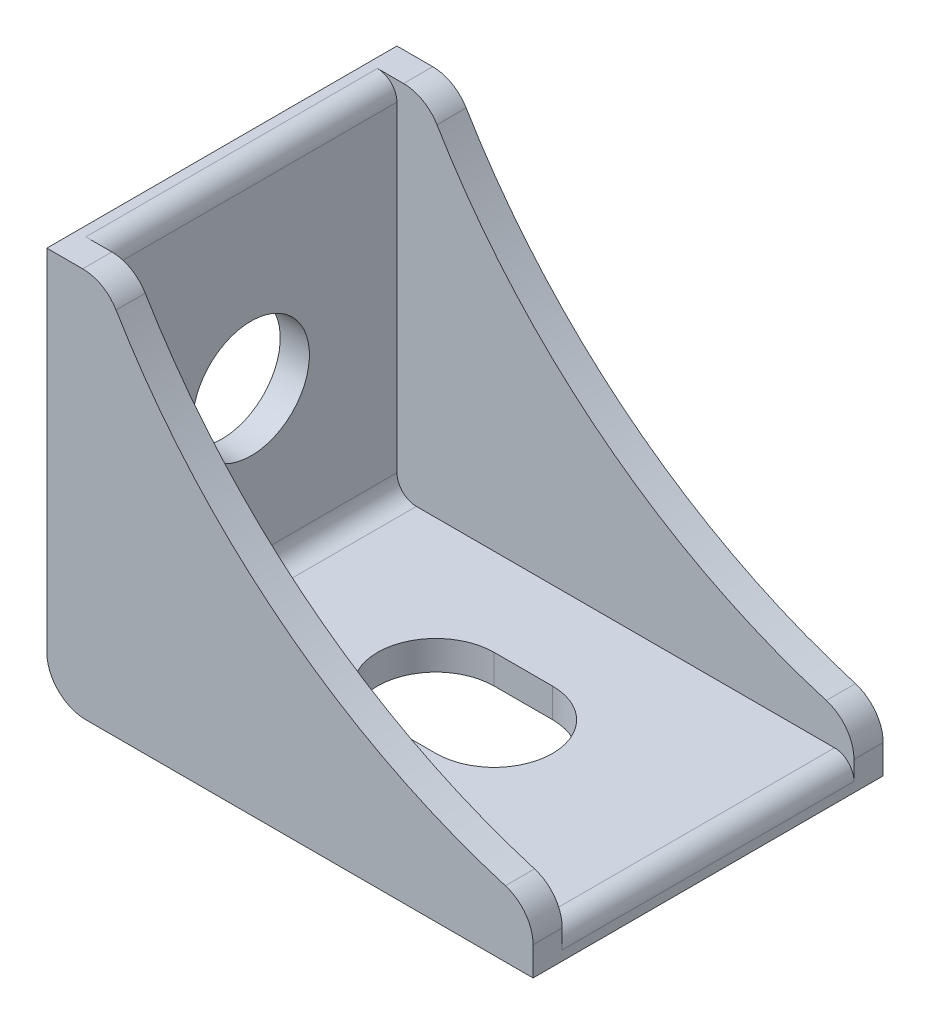
ISO-10303-21;
HEADER;
FILE_DESCRIPTION(('STEP AP214'),'2;1');
FILE_NAME('part.step','',(''),(''),'','','');
FILE_SCHEMA(('AUTOMOTIVE_DESIGN { 1 0 10303 214 1 1 1 1 }'));
ENDSEC;
DATA;
#1=APPLICATION_CONTEXT('core data for automotive mechanical design processes');
#2=APPLICATION_PROTOCOL_DEFINITION('international standard','automotive_design',2000,#1);
#3=PRODUCT_CONTEXT('',#1,'mechanical');
#4=PRODUCT('Part','Part','',(#3));
#5=PRODUCT_RELATED_PRODUCT_CATEGORY('part','',(#4));
#6=PRODUCT_DEFINITION_FORMATION('','',#4);
#7=PRODUCT_DEFINITION_CONTEXT('part definition',#1,'design');
#8=PRODUCT_DEFINITION('design','',#6,#7);
#9=PRODUCT_DEFINITION_SHAPE('','',#8);
#10=(LENGTH_UNIT() NAMED_UNIT(*) SI_UNIT(.MILLI.,.METRE.));
#11=(NAMED_UNIT(*) PLANE_ANGLE_UNIT() SI_UNIT($,.RADIAN.));
#12=(NAMED_UNIT(*) SI_UNIT($,.STERADIAN.) SOLID_ANGLE_UNIT());
#13=UNCERTAINTY_MEASURE_WITH_UNIT(LENGTH_MEASURE(1.E-05),#10,'distance_accuracy_value','');
#14=(GEOMETRIC_REPRESENTATION_CONTEXT(3) GLOBAL_UNCERTAINTY_ASSIGNED_CONTEXT((#13)) GLOBAL_UNIT_ASSIGNED_CONTEXT((#10,
#11,#12)) REPRESENTATION_CONTEXT('',''));
#15=CARTESIAN_POINT('',(0.,0.,0.));
#16=DIRECTION('',(0.,0.,1.));
#17=DIRECTION('',(1.,0.,0.));
#18=AXIS2_PLACEMENT_3D('',#15,#16,#17);
#19=CARTESIAN_POINT('',(33.640222937901,36.9167590961072,-20.));
#20=DIRECTION('',(0.,0.,1.));
#21=DIRECTION('',(1.,0.,0.));
#22=AXIS2_PLACEMENT_3D('',#19,#20,#21);
#23=CYLINDRICAL_SURFACE('',#22,35.);
#24=CARTESIAN_POINT('',(33.640222937901,36.9167590961072,-18.));
#25=DIRECTION('',(0.,0.,1.));
#26=DIRECTION('',(1.,0.,0.));
#27=AXIS2_PLACEMENT_3D('',#24,#25,#26);
#28=CIRCLE('',#27,35.);
#29=CARTESIAN_POINT('',(3.56038789423049,19.0225275187085,-18.));
#30=VERTEX_POINT('',#29);
#31=CARTESIAN_POINT('',(23.5751471858325,3.39521005515261,-18.));
#32=VERTEX_POINT('',#31);
#33=EDGE_CURVE('E233',#30,#32,#28,.T.);
#34=ORIENTED_EDGE('',*,*,#33,.F.);
#35=DIRECTION('',(0.,0.,1.));
#36=VECTOR('',#35,1.);
#37=CARTESIAN_POINT('',(3.56038789423049,19.0225275187085,-20.));
#38=LINE('',#37,#36);
#39=CARTESIAN_POINT('',(3.56038789423049,19.0225275187085,-16.5));
#40=VERTEX_POINT('',#39);
#41=EDGE_CURVE('E363',#30,#40,#38,.T.);
#42=ORIENTED_EDGE('',*,*,#41,.T.);
#43=CARTESIAN_POINT('',(33.640222937901,36.9167590961072,-16.5));
#44=DIRECTION('',(0.,0.,-1.));
#45=DIRECTION('',(-1.,0.,0.));
#46=AXIS2_PLACEMENT_3D('',#43,#44,#45);
#47=CIRCLE('',#46,35.);
#48=CARTESIAN_POINT('',(23.5751471858325,3.39521005515261,-16.5));
#49=VERTEX_POINT('',#48);
#50=EDGE_CURVE('E280',#40,#49,#47,.F.);
#51=ORIENTED_EDGE('',*,*,#50,.T.);
#52=DIRECTION('',(0.,0.,1.));
#53=VECTOR('',#52,1.);
#54=CARTESIAN_POINT('',(23.5751471858325,3.3952100551526,-20.));
#55=LINE('',#54,#53);
#56=EDGE_CURVE('E360',#49,#32,#55,.F.);
#57=ORIENTED_EDGE('',*,*,#56,.T.);
#58=EDGE_LOOP('',(#34,#42,#51,#57));
#59=FACE_BOUND('',#58,.T.);
#60=ADVANCED_FACE('F39',(#59),#23,.F.);
#61=CARTESIAN_POINT('',(0.,20.,0.));
#62=DIRECTION('',(1.,0.,0.));
#63=DIRECTION('',(0.,0.,-1.));
#64=AXIS2_PLACEMENT_3D('',#61,#62,#63);
#65=PLANE('',#64);
#66=CARTESIAN_POINT('',(0.,10.,-9.));
#67=DIRECTION('',(-1.,0.,0.));
#68=DIRECTION('',(0.,0.,1.));
#69=AXIS2_PLACEMENT_3D('',#66,#67,#68);
#70=CIRCLE('',#69,3.);
#71=CARTESIAN_POINT('',(0.,10.,-6.));
#72=VERTEX_POINT('',#71);
#73=EDGE_CURVE('E226',#72,#72,#70,.T.);
#74=ORIENTED_EDGE('',*,*,#73,.F.);
#75=EDGE_LOOP('',(#74));
#76=FACE_BOUND('',#75,.T.);
#77=DIRECTION('',(0.,-1.,0.));
#78=VECTOR('',#77,1.);
#79=CARTESIAN_POINT('',(0.,20.,-18.));
#80=LINE('',#79,#78);
#81=CARTESIAN_POINT('',(0.,20.,-18.));
#82=VERTEX_POINT('',#81);
#83=CARTESIAN_POINT('',(0.,2.,-18.));
#84=VERTEX_POINT('',#83);
#85=EDGE_CURVE('E250',#82,#84,#80,.T.);
#86=ORIENTED_EDGE('',*,*,#85,.T.);
#87=DIRECTION('',(0.,0.,1.));
#88=VECTOR('',#87,1.);
#89=CARTESIAN_POINT('',(0.,2.,0.));
#90=LINE('',#89,#88);
#91=CARTESIAN_POINT('',(0.,2.,0.));
#92=VERTEX_POINT('',#91);
#93=EDGE_CURVE('E327',#84,#92,#90,.T.);
#94=ORIENTED_EDGE('',*,*,#93,.T.);
#95=DIRECTION('',(0.,-1.,0.));
#96=VECTOR('',#95,1.);
#97=CARTESIAN_POINT('',(0.,20.,0.));
#98=LINE('',#97,#96);
#99=CARTESIAN_POINT('',(0.,20.,0.));
#100=VERTEX_POINT('',#99);
#101=EDGE_CURVE('E199',#100,#92,#98,.T.);
#102=ORIENTED_EDGE('',*,*,#101,.F.);
#103=DIRECTION('',(0.,0.,1.));
#104=VECTOR('',#103,1.);
#105=CARTESIAN_POINT('',(0.,20.,0.));
#106=LINE('',#105,#104);
#107=EDGE_CURVE('E238',#82,#100,#106,.T.);
#108=ORIENTED_EDGE('',*,*,#107,.F.);
#109=EDGE_LOOP('',(#86,#94,#102,#108));
#110=FACE_BOUND('',#109,.T.);
#111=ADVANCED_FACE('F501',(#76,#110),#65,.F.);
#112=CARTESIAN_POINT('',(0.,20.,0.));
#113=DIRECTION('',(0.,0.,-1.));
#114=DIRECTION('',(-1.,0.,0.));
#115=AXIS2_PLACEMENT_3D('',#112,#113,#114);
#116=PLANE('',#115);
#117=ORIENTED_EDGE('',*,*,#101,.T.);
#118=CARTESIAN_POINT('',(2.,2.,0.));
#119=DIRECTION('',(0.,0.,-1.));
#120=DIRECTION('',(-1.,0.,0.));
#121=AXIS2_PLACEMENT_3D('',#118,#119,#120);
#122=CIRCLE('',#121,2.);
#123=CARTESIAN_POINT('',(2.,0.,0.));
#124=VERTEX_POINT('',#123);
#125=EDGE_CURVE('E337',#92,#124,#122,.F.);
#126=ORIENTED_EDGE('',*,*,#125,.T.);
#127=DIRECTION('',(1.,0.,0.));
#128=VECTOR('',#127,1.);
#129=CARTESIAN_POINT('',(0.,0.,0.));
#130=LINE('',#129,#128);
#131=CARTESIAN_POINT('',(25.,0.,0.));
#132=VERTEX_POINT('',#131);
#133=EDGE_CURVE('E237',#124,#132,#130,.T.);
#134=ORIENTED_EDGE('',*,*,#133,.T.);
#135=DIRECTION('',(0.,-1.,0.));
#136=VECTOR('',#135,1.);
#137=CARTESIAN_POINT('',(25.,20.,0.));
#138=LINE('',#137,#136);
#139=CARTESIAN_POINT('',(25.,1.47969296709806,0.));
#140=VERTEX_POINT('',#139);
#141=EDGE_CURVE('E266',#140,#132,#138,.T.);
#142=ORIENTED_EDGE('',*,*,#141,.F.);
#143=CARTESIAN_POINT('',(23.,1.47969296709806,0.));
#144=DIRECTION('',(0.,0.,-1.));
#145=DIRECTION('',(-1.,0.,0.));
#146=AXIS2_PLACEMENT_3D('',#143,#144,#145);
#147=CIRCLE('',#146,2.);
#148=CARTESIAN_POINT('',(23.5751471858325,3.39521005515261,0.));
#149=VERTEX_POINT('',#148);
#150=EDGE_CURVE('E334',#140,#149,#147,.F.);
#151=ORIENTED_EDGE('',*,*,#150,.T.);
#152=CARTESIAN_POINT('',(33.640222937901,36.9167590961072,0.));
#153=DIRECTION('',(0.,0.,1.));
#154=DIRECTION('',(1.,0.,0.));
#155=AXIS2_PLACEMENT_3D('',#152,#153,#154);
#156=CIRCLE('',#155,35.);
#157=CARTESIAN_POINT('',(3.56038789423049,19.0225275187085,0.));
#158=VERTEX_POINT('',#157);
#159=EDGE_CURVE('E230',#158,#149,#156,.T.);
#160=ORIENTED_EDGE('',*,*,#159,.F.);
#161=CARTESIAN_POINT('',(1.84154017744932,18.,0.));
#162=DIRECTION('',(0.,0.,-1.));
#163=DIRECTION('',(-1.,0.,0.));
#164=AXIS2_PLACEMENT_3D('',#161,#162,#163);
#165=CIRCLE('',#164,2.);
#166=CARTESIAN_POINT('',(1.84154017744932,20.,0.));
#167=VERTEX_POINT('',#166);
#168=EDGE_CURVE('E331',#158,#167,#165,.F.);
#169=ORIENTED_EDGE('',*,*,#168,.T.);
#170=DIRECTION('',(1.,0.,0.));
#171=VECTOR('',#170,1.);
#172=CARTESIAN_POINT('',(0.,20.,0.));
#173=LINE('',#172,#171);
#174=EDGE_CURVE('E242',#100,#167,#173,.T.);
#175=ORIENTED_EDGE('',*,*,#174,.F.);
#176=EDGE_LOOP('',(#117,#126,#134,#142,#151,#160,#169,#175));
#177=FACE_BOUND('',#176,.T.);
#178=ADVANCED_FACE('F470',(#177),#116,.F.);
#179=CARTESIAN_POINT('',(25.,20.,0.));
#180=DIRECTION('',(-1.,0.,0.));
#181=DIRECTION('',(0.,0.,1.));
#182=AXIS2_PLACEMENT_3D('',#179,#180,#181);
#183=PLANE('',#182);
#184=DIRECTION('',(0.,-1.,0.));
#185=VECTOR('',#184,1.);
#186=CARTESIAN_POINT('',(25.,20.,-18.));
#187=LINE('',#186,#185);
#188=CARTESIAN_POINT('',(25.,1.47969296709806,-18.));
#189=VERTEX_POINT('',#188);
#190=CARTESIAN_POINT('',(25.,0.,-18.));
#191=VERTEX_POINT('',#190);
#192=EDGE_CURVE('E263',#189,#191,#187,.T.);
#193=ORIENTED_EDGE('',*,*,#192,.F.);
#194=DIRECTION('',(0.,0.,1.));
#195=VECTOR('',#194,1.);
#196=CARTESIAN_POINT('',(25.,1.47969296709806,0.));
#197=LINE('',#196,#195);
#198=CARTESIAN_POINT('',(25.,1.47969296709806,-16.5));
#199=VERTEX_POINT('',#198);
#200=EDGE_CURVE('E376',#189,#199,#197,.T.);
#201=ORIENTED_EDGE('',*,*,#200,.T.);
#202=DIRECTION('',(0.,1.,0.));
#203=VECTOR('',#202,1.);
#204=CARTESIAN_POINT('',(25.,1.5,-16.5));
#205=LINE('',#204,#203);
#206=CARTESIAN_POINT('',(25.,0.500000000000001,-16.5));
#207=VERTEX_POINT('',#206);
#208=EDGE_CURVE('E414',#207,#199,#205,.T.);
#209=ORIENTED_EDGE('',*,*,#208,.F.);
#210=DIRECTION('',(0.,0.,-1.));
#211=VECTOR('',#210,1.);
#212=CARTESIAN_POINT('',(25.,0.5,0.));
#213=LINE('',#212,#211);
#214=CARTESIAN_POINT('',(25.,0.500000000000001,-1.5));
#215=VERTEX_POINT('',#214);
#216=EDGE_CURVE('E292',#207,#215,#213,.F.);
#217=ORIENTED_EDGE('',*,*,#216,.T.);
#218=DIRECTION('',(0.,1.,0.));
#219=VECTOR('',#218,1.);
#220=CARTESIAN_POINT('',(25.,1.5,-1.5));
#221=LINE('',#220,#219);
#222=CARTESIAN_POINT('',(25.,1.47969296709806,-1.5));
#223=VERTEX_POINT('',#222);
#224=EDGE_CURVE('E409',#215,#223,#221,.T.);
#225=ORIENTED_EDGE('',*,*,#224,.T.);
#226=DIRECTION('',(0.,0.,1.));
#227=VECTOR('',#226,1.);
#228=CARTESIAN_POINT('',(25.,1.47969296709806,0.));
#229=LINE('',#228,#227);
#230=EDGE_CURVE('E372',#223,#140,#229,.T.);
#231=ORIENTED_EDGE('',*,*,#230,.T.);
#232=ORIENTED_EDGE('',*,*,#141,.T.);
#233=DIRECTION('',(0.,0.,-1.));
#234=VECTOR('',#233,1.);
#235=CARTESIAN_POINT('',(25.,0.,0.));
#236=LINE('',#235,#234);
#237=EDGE_CURVE('E253',#132,#191,#236,.T.);
#238=ORIENTED_EDGE('',*,*,#237,.T.);
#239=EDGE_LOOP('',(#193,#201,#209,#217,#225,#231,#232,#238));
#240=FACE_BOUND('',#239,.T.);
#241=ADVANCED_FACE('F478',(#240),#183,.F.);
#242=CARTESIAN_POINT('',(0.,20.,-18.));
#243=DIRECTION('',(0.,0.,1.));
#244=DIRECTION('',(1.,0.,0.));
#245=AXIS2_PLACEMENT_3D('',#242,#243,#244);
#246=PLANE('',#245);
#247=DIRECTION('',(-1.,0.,0.));
#248=VECTOR('',#247,1.);
#249=CARTESIAN_POINT('',(0.,0.,-18.));
#250=LINE('',#249,#248);
#251=CARTESIAN_POINT('',(1.99999999999999,0.,-18.));
#252=VERTEX_POINT('',#251);
#253=EDGE_CURVE('E243',#191,#252,#250,.T.);
#254=ORIENTED_EDGE('',*,*,#253,.T.);
#255=CARTESIAN_POINT('',(1.99999999999999,2.,-18.));
#256=DIRECTION('',(0.,0.,1.));
#257=DIRECTION('',(1.,0.,0.));
#258=AXIS2_PLACEMENT_3D('',#255,#256,#257);
#259=CIRCLE('',#258,2.);
#260=EDGE_CURVE('E349',#252,#84,#259,.F.);
#261=ORIENTED_EDGE('',*,*,#260,.T.);
#262=ORIENTED_EDGE('',*,*,#85,.F.);
#263=DIRECTION('',(-1.,0.,0.));
#264=VECTOR('',#263,1.);
#265=CARTESIAN_POINT('',(0.,20.,-18.));
#266=LINE('',#265,#264);
#267=CARTESIAN_POINT('',(1.84154017744932,20.,-18.));
#268=VERTEX_POINT('',#267);
#269=EDGE_CURVE('E247',#268,#82,#266,.T.);
#270=ORIENTED_EDGE('',*,*,#269,.F.);
#271=CARTESIAN_POINT('',(1.84154017744932,18.,-18.));
#272=DIRECTION('',(0.,0.,1.));
#273=DIRECTION('',(1.,0.,0.));
#274=AXIS2_PLACEMENT_3D('',#271,#272,#273);
#275=CIRCLE('',#274,2.);
#276=EDGE_CURVE('E346',#268,#30,#275,.F.);
#277=ORIENTED_EDGE('',*,*,#276,.T.);
#278=ORIENTED_EDGE('',*,*,#33,.T.);
#279=CARTESIAN_POINT('',(23.,1.47969296709806,-18.));
#280=DIRECTION('',(0.,0.,1.));
#281=DIRECTION('',(1.,0.,0.));
#282=AXIS2_PLACEMENT_3D('',#279,#280,#281);
#283=CIRCLE('',#282,2.);
#284=EDGE_CURVE('E343',#32,#189,#283,.F.);
#285=ORIENTED_EDGE('',*,*,#284,.T.);
#286=ORIENTED_EDGE('',*,*,#192,.T.);
#287=EDGE_LOOP('',(#254,#261,#262,#270,#277,#278,#285,#286));
#288=FACE_BOUND('',#287,.T.);
#289=ADVANCED_FACE('F495',(#288),#246,.F.);
#290=CARTESIAN_POINT('',(0.,20.,0.));
#291=DIRECTION('',(0.,-1.,0.));
#292=DIRECTION('',(0.,0.,-1.));
#293=AXIS2_PLACEMENT_3D('',#290,#291,#292);
#294=PLANE('',#293);
#295=DIRECTION('',(-1.,0.,0.));
#296=VECTOR('',#295,1.);
#297=CARTESIAN_POINT('',(1.49999999999999,20.,-16.5));
#298=LINE('',#297,#296);
#299=CARTESIAN_POINT('',(1.84154017744932,20.,-16.5));
#300=VERTEX_POINT('',#299);
#301=CARTESIAN_POINT('',(0.499999999999993,20.,-16.5));
#302=VERTEX_POINT('',#301);
#303=EDGE_CURVE('E421',#300,#302,#298,.T.);
#304=ORIENTED_EDGE('',*,*,#303,.F.);
#305=DIRECTION('',(0.,0.,1.));
#306=VECTOR('',#305,1.);
#307=CARTESIAN_POINT('',(1.84154017744932,20.,0.));
#308=LINE('',#307,#306);
#309=EDGE_CURVE('E356',#300,#268,#308,.F.);
#310=ORIENTED_EDGE('',*,*,#309,.T.);
#311=ORIENTED_EDGE('',*,*,#269,.T.);
#312=ORIENTED_EDGE('',*,*,#107,.T.);
#313=ORIENTED_EDGE('',*,*,#174,.T.);
#314=DIRECTION('',(0.,0.,1.));
#315=VECTOR('',#314,1.);
#316=CARTESIAN_POINT('',(1.84154017744932,20.,0.));
#317=LINE('',#316,#315);
#318=CARTESIAN_POINT('',(1.84154017744932,20.,-1.5));
#319=VERTEX_POINT('',#318);
#320=EDGE_CURVE('E352',#167,#319,#317,.F.);
#321=ORIENTED_EDGE('',*,*,#320,.T.);
#322=DIRECTION('',(1.,0.,0.));
#323=VECTOR('',#322,1.);
#324=CARTESIAN_POINT('',(1.49999999999999,20.,-1.5));
#325=LINE('',#324,#323);
#326=CARTESIAN_POINT('',(0.499999999999993,20.,-1.5));
#327=VERTEX_POINT('',#326);
#328=EDGE_CURVE('E425',#327,#319,#325,.T.);
#329=ORIENTED_EDGE('',*,*,#328,.F.);
#330=DIRECTION('',(0.,0.,1.));
#331=VECTOR('',#330,1.);
#332=CARTESIAN_POINT('',(0.499999999999993,20.,0.));
#333=LINE('',#332,#331);
#334=EDGE_CURVE('E309',#327,#302,#333,.F.);
#335=ORIENTED_EDGE('',*,*,#334,.T.);
#336=EDGE_LOOP('',(#304,#310,#311,#312,#313,#321,#329,#335));
#337=FACE_BOUND('',#336,.T.);
#338=ADVANCED_FACE('F462',(#337),#294,.F.);
#339=CARTESIAN_POINT('',(0.,0.,0.));
#340=DIRECTION('',(0.,-1.,0.));
#341=DIRECTION('',(0.,0.,-1.));
#342=AXIS2_PLACEMENT_3D('',#339,#340,#341);
#343=PLANE('',#342);
#344=CARTESIAN_POINT('',(11.,0.,-9.));
#345=DIRECTION('',(0.,-1.,0.));
#346=DIRECTION('',(0.,0.,-1.));
#347=AXIS2_PLACEMENT_3D('',#344,#345,#346);
#348=CIRCLE('',#347,3.);
#349=CARTESIAN_POINT('',(11.,0.,-6.));
#350=VERTEX_POINT('',#349);
#351=CARTESIAN_POINT('',(11.,0.,-12.));
#352=VERTEX_POINT('',#351);
#353=EDGE_CURVE('E277',#350,#352,#348,.T.);
#354=ORIENTED_EDGE('',*,*,#353,.F.);
#355=DIRECTION('',(-1.,0.,0.));
#356=VECTOR('',#355,1.);
#357=CARTESIAN_POINT('',(11.,0.,-6.));
#358=LINE('',#357,#356);
#359=CARTESIAN_POINT('',(14.,0.,-6.));
#360=VERTEX_POINT('',#359);
#361=EDGE_CURVE('E222',#360,#350,#358,.T.);
#362=ORIENTED_EDGE('',*,*,#361,.F.);
#363=CARTESIAN_POINT('',(14.,0.,-9.));
#364=DIRECTION('',(0.,-1.,0.));
#365=DIRECTION('',(0.,0.,-1.));
#366=AXIS2_PLACEMENT_3D('',#363,#364,#365);
#367=CIRCLE('',#366,3.);
#368=CARTESIAN_POINT('',(14.,0.,-12.));
#369=VERTEX_POINT('',#368);
#370=EDGE_CURVE('E393',#369,#360,#367,.T.);
#371=ORIENTED_EDGE('',*,*,#370,.F.);
#372=DIRECTION('',(1.,0.,0.));
#373=VECTOR('',#372,1.);
#374=CARTESIAN_POINT('',(11.,0.,-12.));
#375=LINE('',#374,#373);
#376=EDGE_CURVE('E213',#352,#369,#375,.T.);
#377=ORIENTED_EDGE('',*,*,#376,.F.);
#378=EDGE_LOOP('',(#354,#362,#371,#377));
#379=FACE_BOUND('',#378,.T.);
#380=ORIENTED_EDGE('',*,*,#133,.F.);
#381=DIRECTION('',(0.,0.,1.));
#382=VECTOR('',#381,1.);
#383=CARTESIAN_POINT('',(1.99999999999999,0.,-18.));
#384=LINE('',#383,#382);
#385=EDGE_CURVE('E340',#124,#252,#384,.F.);
#386=ORIENTED_EDGE('',*,*,#385,.T.);
#387=ORIENTED_EDGE('',*,*,#253,.F.);
#388=ORIENTED_EDGE('',*,*,#237,.F.);
#389=EDGE_LOOP('',(#380,#386,#387,#388));
#390=FACE_BOUND('',#389,.T.);
#391=ADVANCED_FACE('F506',(#379,#390),#343,.T.);
#392=ORIENTED_EDGE('',*,*,#159,.T.);
#393=DIRECTION('',(0.,0.,1.));
#394=VECTOR('',#393,1.);
#395=CARTESIAN_POINT('',(23.5751471858325,3.3952100551526,-20.));
#396=LINE('',#395,#394);
#397=CARTESIAN_POINT('',(23.5751471858325,3.39521005515261,-1.5));
#398=VERTEX_POINT('',#397);
#399=EDGE_CURVE('E61',#149,#398,#396,.F.);
#400=ORIENTED_EDGE('',*,*,#399,.T.);
#401=CARTESIAN_POINT('',(33.640222937901,36.9167590961072,-1.5));
#402=DIRECTION('',(0.,0.,1.));
#403=DIRECTION('',(1.,0.,0.));
#404=AXIS2_PLACEMENT_3D('',#401,#402,#403);
#405=CIRCLE('',#404,35.);
#406=CARTESIAN_POINT('',(3.56038789423049,19.0225275187085,-1.5));
#407=VERTEX_POINT('',#406);
#408=EDGE_CURVE('E198',#398,#407,#405,.F.);
#409=ORIENTED_EDGE('',*,*,#408,.T.);
#410=DIRECTION('',(0.,0.,1.));
#411=VECTOR('',#410,1.);
#412=CARTESIAN_POINT('',(3.56038789423049,19.0225275187085,-20.));
#413=LINE('',#412,#411);
#414=EDGE_CURVE('E380',#407,#158,#413,.T.);
#415=ORIENTED_EDGE('',*,*,#414,.T.);
#416=EDGE_LOOP('',(#392,#400,#409,#415));
#417=FACE_BOUND('',#416,.T.);
#418=ADVANCED_FACE('F468',(#417),#23,.F.);
#419=CARTESIAN_POINT('',(25.,10.,-9.00000000000001));
#420=DIRECTION('',(-1.,0.,0.));
#421=DIRECTION('',(0.,0.,1.));
#422=AXIS2_PLACEMENT_3D('',#419,#420,#421);
#423=CYLINDRICAL_SURFACE('',#422,3.);
#424=CARTESIAN_POINT('',(1.49999999999999,10.,-9.));
#425=DIRECTION('',(-1.,0.,0.));
#426=DIRECTION('',(0.,0.,1.));
#427=AXIS2_PLACEMENT_3D('',#424,#425,#426);
#428=CIRCLE('',#427,3.);
#429=CARTESIAN_POINT('',(1.49999999999999,10.,-6.));
#430=VERTEX_POINT('',#429);
#431=EDGE_CURVE('E273',#430,#430,#428,.F.);
#432=ORIENTED_EDGE('',*,*,#431,.T.);
#433=EDGE_LOOP('',(#432));
#434=FACE_BOUND('',#433,.T.);
#435=ORIENTED_EDGE('',*,*,#73,.T.);
#436=EDGE_LOOP('',(#435));
#437=FACE_BOUND('',#436,.T.);
#438=ADVANCED_FACE('F527',(#434,#437),#423,.F.);
#439=CARTESIAN_POINT('',(14.,20.,-9.));
#440=DIRECTION('',(0.,-1.,0.));
#441=DIRECTION('',(0.,0.,-1.));
#442=AXIS2_PLACEMENT_3D('',#439,#440,#441);
#443=CYLINDRICAL_SURFACE('',#442,3.);
#444=DIRECTION('',(0.,-1.,0.));
#445=VECTOR('',#444,1.);
#446=CARTESIAN_POINT('',(14.,20.,-6.));
#447=LINE('',#446,#445);
#448=CARTESIAN_POINT('',(14.,1.5,-6.));
#449=VERTEX_POINT('',#448);
#450=EDGE_CURVE('E207',#449,#360,#447,.T.);
#451=ORIENTED_EDGE('',*,*,#450,.F.);
#452=CARTESIAN_POINT('',(14.,1.5,-9.));
#453=DIRECTION('',(0.,-1.,0.));
#454=DIRECTION('',(0.,0.,-1.));
#455=AXIS2_PLACEMENT_3D('',#452,#453,#454);
#456=CIRCLE('',#455,3.);
#457=CARTESIAN_POINT('',(14.,1.5,-12.));
#458=VERTEX_POINT('',#457);
#459=EDGE_CURVE('E190',#449,#458,#456,.F.);
#460=ORIENTED_EDGE('',*,*,#459,.T.);
#461=DIRECTION('',(0.,-1.,0.));
#462=VECTOR('',#461,1.);
#463=CARTESIAN_POINT('',(14.,20.,-12.));
#464=LINE('',#463,#462);
#465=EDGE_CURVE('E205',#458,#369,#464,.T.);
#466=ORIENTED_EDGE('',*,*,#465,.T.);
#467=ORIENTED_EDGE('',*,*,#370,.T.);
#468=EDGE_LOOP('',(#451,#460,#466,#467));
#469=FACE_BOUND('',#468,.T.);
#470=ADVANCED_FACE('F203',(#469),#443,.F.);
#471=CARTESIAN_POINT('',(11.,20.,-9.));
#472=DIRECTION('',(0.,-1.,0.));
#473=DIRECTION('',(0.,0.,-1.));
#474=AXIS2_PLACEMENT_3D('',#471,#472,#473);
#475=CYLINDRICAL_SURFACE('',#474,3.);
#476=DIRECTION('',(0.,-1.,0.));
#477=VECTOR('',#476,1.);
#478=CARTESIAN_POINT('',(11.,20.,-12.));
#479=LINE('',#478,#477);
#480=CARTESIAN_POINT('',(11.,1.5,-12.));
#481=VERTEX_POINT('',#480);
#482=EDGE_CURVE('E216',#481,#352,#479,.T.);
#483=ORIENTED_EDGE('',*,*,#482,.F.);
#484=CARTESIAN_POINT('',(11.,1.5,-9.));
#485=DIRECTION('',(0.,-1.,0.));
#486=DIRECTION('',(0.,0.,-1.));
#487=AXIS2_PLACEMENT_3D('',#484,#485,#486);
#488=CIRCLE('',#487,3.);
#489=CARTESIAN_POINT('',(11.,1.5,-6.));
#490=VERTEX_POINT('',#489);
#491=EDGE_CURVE('E193',#481,#490,#488,.F.);
#492=ORIENTED_EDGE('',*,*,#491,.T.);
#493=DIRECTION('',(0.,-1.,0.));
#494=VECTOR('',#493,1.);
#495=CARTESIAN_POINT('',(11.,20.,-6.));
#496=LINE('',#495,#494);
#497=EDGE_CURVE('E220',#490,#350,#496,.T.);
#498=ORIENTED_EDGE('',*,*,#497,.T.);
#499=ORIENTED_EDGE('',*,*,#353,.T.);
#500=EDGE_LOOP('',(#483,#492,#498,#499));
#501=FACE_BOUND('',#500,.T.);
#502=ADVANCED_FACE('F681',(#501),#475,.F.);
#503=CARTESIAN_POINT('',(11.,20.,-6.));
#504=DIRECTION('',(0.,0.,1.));
#505=DIRECTION('',(1.,0.,0.));
#506=AXIS2_PLACEMENT_3D('',#503,#504,#505);
#507=PLANE('',#506);
#508=ORIENTED_EDGE('',*,*,#497,.F.);
#509=DIRECTION('',(1.,0.,0.));
#510=VECTOR('',#509,1.);
#511=CARTESIAN_POINT('',(11.,1.5,-6.));
#512=LINE('',#511,#510);
#513=EDGE_CURVE('E209',#490,#449,#512,.T.);
#514=ORIENTED_EDGE('',*,*,#513,.T.);
#515=ORIENTED_EDGE('',*,*,#450,.T.);
#516=ORIENTED_EDGE('',*,*,#361,.T.);
#517=EDGE_LOOP('',(#508,#514,#515,#516));
#518=FACE_BOUND('',#517,.T.);
#519=ADVANCED_FACE('F678',(#518),#507,.F.);
#520=CARTESIAN_POINT('',(11.,20.,-12.));
#521=DIRECTION('',(0.,0.,-1.));
#522=DIRECTION('',(-1.,0.,0.));
#523=AXIS2_PLACEMENT_3D('',#520,#521,#522);
#524=PLANE('',#523);
#525=ORIENTED_EDGE('',*,*,#465,.F.);
#526=DIRECTION('',(-1.,0.,0.));
#527=VECTOR('',#526,1.);
#528=CARTESIAN_POINT('',(11.,1.5,-12.));
#529=LINE('',#528,#527);
#530=EDGE_CURVE('E187',#458,#481,#529,.T.);
#531=ORIENTED_EDGE('',*,*,#530,.T.);
#532=ORIENTED_EDGE('',*,*,#482,.T.);
#533=ORIENTED_EDGE('',*,*,#376,.T.);
#534=EDGE_LOOP('',(#525,#531,#532,#533));
#535=FACE_BOUND('',#534,.T.);
#536=ADVANCED_FACE('F211',(#535),#524,.F.);
#537=CARTESIAN_POINT('',(1.49999999999999,1.5,-16.5));
#538=DIRECTION('',(0.,0.,-1.));
#539=DIRECTION('',(-1.,0.,0.));
#540=AXIS2_PLACEMENT_3D('',#537,#538,#539);
#541=PLANE('',#540);
#542=ORIENTED_EDGE('',*,*,#50,.F.);
#543=CARTESIAN_POINT('',(1.84154017744932,18.,-16.5));
#544=DIRECTION('',(0.,0.,-1.));
#545=DIRECTION('',(-1.,0.,0.));
#546=AXIS2_PLACEMENT_3D('',#543,#544,#545);
#547=CIRCLE('',#546,2.);
#548=EDGE_CURVE('E369',#40,#300,#547,.F.);
#549=ORIENTED_EDGE('',*,*,#548,.T.);
#550=ORIENTED_EDGE('',*,*,#303,.T.);
#551=CARTESIAN_POINT('',(0.499999999999993,19.,-16.5));
#552=DIRECTION('',(0.,0.,-1.));
#553=DIRECTION('',(-1.,0.,0.));
#554=AXIS2_PLACEMENT_3D('',#551,#552,#553);
#555=CIRCLE('',#554,1.);
#556=CARTESIAN_POINT('',(1.49999999999999,19.,-16.5));
#557=VERTEX_POINT('',#556);
#558=EDGE_CURVE('E324',#302,#557,#555,.T.);
#559=ORIENTED_EDGE('',*,*,#558,.T.);
#560=DIRECTION('',(0.,1.,0.));
#561=VECTOR('',#560,1.);
#562=CARTESIAN_POINT('',(1.49999999999999,1.5,-16.5));
#563=LINE('',#562,#561);
#564=CARTESIAN_POINT('',(1.49999999999999,2.5,-16.5));
#565=VERTEX_POINT('',#564);
#566=EDGE_CURVE('E404',#565,#557,#563,.T.);
#567=ORIENTED_EDGE('',*,*,#566,.F.);
#568=CARTESIAN_POINT('',(2.49999999999999,2.5,-16.5));
#569=DIRECTION('',(0.,0.,-1.));
#570=DIRECTION('',(-1.,0.,0.));
#571=AXIS2_PLACEMENT_3D('',#568,#569,#570);
#572=CIRCLE('',#571,1.);
#573=CARTESIAN_POINT('',(2.49999999999999,1.5,-16.5));
#574=VERTEX_POINT('',#573);
#575=EDGE_CURVE('E306',#565,#574,#572,.F.);
#576=ORIENTED_EDGE('',*,*,#575,.T.);
#577=DIRECTION('',(-1.,0.,0.));
#578=VECTOR('',#577,1.);
#579=CARTESIAN_POINT('',(1.49999999999999,1.5,-16.5));
#580=LINE('',#579,#578);
#581=CARTESIAN_POINT('',(24.,1.5,-16.5));
#582=VERTEX_POINT('',#581);
#583=EDGE_CURVE('E410',#582,#574,#580,.T.);
#584=ORIENTED_EDGE('',*,*,#583,.F.);
#585=CARTESIAN_POINT('',(24.,0.500000000000001,-16.5));
#586=DIRECTION('',(0.,0.,-1.));
#587=DIRECTION('',(-1.,0.,0.));
#588=AXIS2_PLACEMENT_3D('',#585,#586,#587);
#589=CIRCLE('',#588,1.);
#590=EDGE_CURVE('E313',#582,#207,#589,.T.);
#591=ORIENTED_EDGE('',*,*,#590,.T.);
#592=ORIENTED_EDGE('',*,*,#208,.T.);
#593=CARTESIAN_POINT('',(23.,1.47969296709806,-16.5));
#594=DIRECTION('',(0.,0.,-1.));
#595=DIRECTION('',(-1.,0.,0.));
#596=AXIS2_PLACEMENT_3D('',#593,#594,#595);
#597=CIRCLE('',#596,2.);
#598=EDGE_CURVE('E366',#199,#49,#597,.F.);
#599=ORIENTED_EDGE('',*,*,#598,.T.);
#600=EDGE_LOOP('',(#542,#549,#550,#559,#567,#576,#584,#591,#592,#599));
#601=FACE_BOUND('',#600,.T.);
#602=ADVANCED_FACE('F444',(#601),#541,.F.);
#603=CARTESIAN_POINT('',(1.49999999999999,1.5,-1.5));
#604=DIRECTION('',(0.,0.,1.));
#605=DIRECTION('',(1.,0.,0.));
#606=AXIS2_PLACEMENT_3D('',#603,#604,#605);
#607=PLANE('',#606);
#608=ORIENTED_EDGE('',*,*,#408,.F.);
#609=CARTESIAN_POINT('',(23.,1.47969296709806,-1.5));
#610=DIRECTION('',(0.,0.,1.));
#611=DIRECTION('',(1.,0.,0.));
#612=AXIS2_PLACEMENT_3D('',#609,#610,#611);
#613=CIRCLE('',#612,2.);
#614=EDGE_CURVE('E11',#398,#223,#613,.F.);
#615=ORIENTED_EDGE('',*,*,#614,.T.);
#616=ORIENTED_EDGE('',*,*,#224,.F.);
#617=CARTESIAN_POINT('',(24.,0.500000000000001,-1.5));
#618=DIRECTION('',(0.,0.,1.));
#619=DIRECTION('',(1.,0.,0.));
#620=AXIS2_PLACEMENT_3D('',#617,#618,#619);
#621=CIRCLE('',#620,1.);
#622=CARTESIAN_POINT('',(24.,1.5,-1.5));
#623=VERTEX_POINT('',#622);
#624=EDGE_CURVE('E317',#215,#623,#621,.T.);
#625=ORIENTED_EDGE('',*,*,#624,.T.);
#626=DIRECTION('',(1.,0.,0.));
#627=VECTOR('',#626,1.);
#628=CARTESIAN_POINT('',(1.49999999999999,1.5,-1.5));
#629=LINE('',#628,#627);
#630=CARTESIAN_POINT('',(2.49999999999999,1.5,-1.5));
#631=VERTEX_POINT('',#630);
#632=EDGE_CURVE('E424',#631,#623,#629,.T.);
#633=ORIENTED_EDGE('',*,*,#632,.F.);
#634=CARTESIAN_POINT('',(2.49999999999999,2.5,-1.5));
#635=DIRECTION('',(0.,0.,1.));
#636=DIRECTION('',(1.,0.,0.));
#637=AXIS2_PLACEMENT_3D('',#634,#635,#636);
#638=CIRCLE('',#637,1.);
#639=CARTESIAN_POINT('',(1.49999999999999,2.5,-1.5));
#640=VERTEX_POINT('',#639);
#641=EDGE_CURVE('E296',#631,#640,#638,.F.);
#642=ORIENTED_EDGE('',*,*,#641,.T.);
#643=DIRECTION('',(0.,1.,0.));
#644=VECTOR('',#643,1.);
#645=CARTESIAN_POINT('',(1.49999999999999,1.5,-1.5));
#646=LINE('',#645,#644);
#647=CARTESIAN_POINT('',(1.49999999999999,19.,-1.5));
#648=VERTEX_POINT('',#647);
#649=EDGE_CURVE('E405',#640,#648,#646,.T.);
#650=ORIENTED_EDGE('',*,*,#649,.T.);
#651=CARTESIAN_POINT('',(0.499999999999993,19.,-1.5));
#652=DIRECTION('',(0.,0.,1.));
#653=DIRECTION('',(1.,0.,0.));
#654=AXIS2_PLACEMENT_3D('',#651,#652,#653);
#655=CIRCLE('',#654,1.);
#656=EDGE_CURVE('E320',#648,#327,#655,.T.);
#657=ORIENTED_EDGE('',*,*,#656,.T.);
#658=ORIENTED_EDGE('',*,*,#328,.T.);
#659=CARTESIAN_POINT('',(1.84154017744932,18.,-1.5));
#660=DIRECTION('',(0.,0.,1.));
#661=DIRECTION('',(1.,0.,0.));
#662=AXIS2_PLACEMENT_3D('',#659,#660,#661);
#663=CIRCLE('',#662,2.);
#664=EDGE_CURVE('E48',#319,#407,#663,.F.);
#665=ORIENTED_EDGE('',*,*,#664,.T.);
#666=EDGE_LOOP('',(#608,#615,#616,#625,#633,#642,#650,#657,#658,#665));
#667=FACE_BOUND('',#666,.T.);
#668=ADVANCED_FACE('F451',(#667),#607,.F.);
#669=CARTESIAN_POINT('',(1.49999999999999,1.5,-1.5));
#670=DIRECTION('',(-1.,0.,0.));
#671=DIRECTION('',(0.,0.,1.));
#672=AXIS2_PLACEMENT_3D('',#669,#670,#671);
#673=PLANE('',#672);
#674=ORIENTED_EDGE('',*,*,#649,.F.);
#675=DIRECTION('',(0.,0.,1.));
#676=VECTOR('',#675,1.);
#677=CARTESIAN_POINT('',(1.49999999999999,2.5,-16.5));
#678=LINE('',#677,#676);
#679=EDGE_CURVE('E303',#640,#565,#678,.F.);
#680=ORIENTED_EDGE('',*,*,#679,.T.);
#681=ORIENTED_EDGE('',*,*,#566,.T.);
#682=DIRECTION('',(0.,0.,1.));
#683=VECTOR('',#682,1.);
#684=CARTESIAN_POINT('',(1.49999999999999,19.,-1.5));
#685=LINE('',#684,#683);
#686=EDGE_CURVE('E299',#557,#648,#685,.T.);
#687=ORIENTED_EDGE('',*,*,#686,.T.);
#688=EDGE_LOOP('',(#674,#680,#681,#687));
#689=FACE_BOUND('',#688,.T.);
#690=ORIENTED_EDGE('',*,*,#431,.F.);
#691=EDGE_LOOP('',(#690));
#692=FACE_BOUND('',#691,.T.);
#693=ADVANCED_FACE('F453',(#689,#692),#673,.F.);
#694=CARTESIAN_POINT('',(0.,1.5,0.));
#695=DIRECTION('',(0.,-1.,0.));
#696=DIRECTION('',(0.,0.,-1.));
#697=AXIS2_PLACEMENT_3D('',#694,#695,#696);
#698=PLANE('',#697);
#699=ORIENTED_EDGE('',*,*,#632,.T.);
#700=DIRECTION('',(0.,0.,-1.));
#701=VECTOR('',#700,1.);
#702=CARTESIAN_POINT('',(24.,1.5,0.));
#703=LINE('',#702,#701);
#704=EDGE_CURVE('E288',#623,#582,#703,.T.);
#705=ORIENTED_EDGE('',*,*,#704,.T.);
#706=ORIENTED_EDGE('',*,*,#583,.T.);
#707=DIRECTION('',(0.,0.,1.));
#708=VECTOR('',#707,1.);
#709=CARTESIAN_POINT('',(2.49999999999999,1.5,-1.5));
#710=LINE('',#709,#708);
#711=EDGE_CURVE('E284',#574,#631,#710,.T.);
#712=ORIENTED_EDGE('',*,*,#711,.T.);
#713=EDGE_LOOP('',(#699,#705,#706,#712));
#714=FACE_BOUND('',#713,.T.);
#715=ORIENTED_EDGE('',*,*,#491,.F.);
#716=ORIENTED_EDGE('',*,*,#530,.F.);
#717=ORIENTED_EDGE('',*,*,#459,.F.);
#718=ORIENTED_EDGE('',*,*,#513,.F.);
#719=EDGE_LOOP('',(#715,#716,#717,#718));
#720=FACE_BOUND('',#719,.T.);
#721=ADVANCED_FACE('F189',(#714,#720),#698,.F.);
#722=CARTESIAN_POINT('',(24.,0.500000000000001,0.));
#723=DIRECTION('',(0.,0.,-1.));
#724=DIRECTION('',(-1.,0.,0.));
#725=AXIS2_PLACEMENT_3D('',#722,#723,#724);
#726=CYLINDRICAL_SURFACE('',#725,1.);
#727=ORIENTED_EDGE('',*,*,#624,.F.);
#728=ORIENTED_EDGE('',*,*,#216,.F.);
#729=ORIENTED_EDGE('',*,*,#590,.F.);
#730=ORIENTED_EDGE('',*,*,#704,.F.);
#731=EDGE_LOOP('',(#727,#728,#729,#730));
#732=FACE_BOUND('',#731,.T.);
#733=ADVANCED_FACE('F440',(#732),#726,.T.);
#734=CARTESIAN_POINT('',(2.49999999999999,2.5,0.));
#735=DIRECTION('',(0.,0.,-1.));
#736=DIRECTION('',(-1.,0.,0.));
#737=AXIS2_PLACEMENT_3D('',#734,#735,#736);
#738=CYLINDRICAL_SURFACE('',#737,1.);
#739=ORIENTED_EDGE('',*,*,#575,.F.);
#740=ORIENTED_EDGE('',*,*,#679,.F.);
#741=ORIENTED_EDGE('',*,*,#641,.F.);
#742=ORIENTED_EDGE('',*,*,#711,.F.);
#743=EDGE_LOOP('',(#739,#740,#741,#742));
#744=FACE_BOUND('',#743,.T.);
#745=ADVANCED_FACE('F448',(#744),#738,.F.);
#746=CARTESIAN_POINT('',(0.499999999999993,19.,-1.5));
#747=DIRECTION('',(0.,0.,1.));
#748=DIRECTION('',(1.,0.,0.));
#749=AXIS2_PLACEMENT_3D('',#746,#747,#748);
#750=CYLINDRICAL_SURFACE('',#749,1.);
#751=ORIENTED_EDGE('',*,*,#558,.F.);
#752=ORIENTED_EDGE('',*,*,#334,.F.);
#753=ORIENTED_EDGE('',*,*,#656,.F.);
#754=ORIENTED_EDGE('',*,*,#686,.F.);
#755=EDGE_LOOP('',(#751,#752,#753,#754));
#756=FACE_BOUND('',#755,.T.);
#757=ADVANCED_FACE('F458',(#756),#750,.T.);
#758=CARTESIAN_POINT('',(2.,2.,0.));
#759=DIRECTION('',(0.,0.,-1.));
#760=DIRECTION('',(-1.,0.,0.));
#761=AXIS2_PLACEMENT_3D('',#758,#759,#760);
#762=CYLINDRICAL_SURFACE('',#761,2.);
#763=ORIENTED_EDGE('',*,*,#260,.F.);
#764=ORIENTED_EDGE('',*,*,#385,.F.);
#765=ORIENTED_EDGE('',*,*,#125,.F.);
#766=ORIENTED_EDGE('',*,*,#93,.F.);
#767=EDGE_LOOP('',(#763,#764,#765,#766));
#768=FACE_BOUND('',#767,.T.);
#769=ADVANCED_FACE('F508',(#768),#762,.T.);
#770=CARTESIAN_POINT('',(1.84154017744932,18.,-20.));
#771=DIRECTION('',(0.,0.,1.));
#772=DIRECTION('',(1.,0.,0.));
#773=AXIS2_PLACEMENT_3D('',#770,#771,#772);
#774=CYLINDRICAL_SURFACE('',#773,2.);
#775=ORIENTED_EDGE('',*,*,#548,.F.);
#776=ORIENTED_EDGE('',*,*,#41,.F.);
#777=ORIENTED_EDGE('',*,*,#276,.F.);
#778=ORIENTED_EDGE('',*,*,#309,.F.);
#779=EDGE_LOOP('',(#775,#776,#777,#778));
#780=FACE_BOUND('',#779,.T.);
#781=ADVANCED_FACE('F490',(#780),#774,.T.);
#782=CARTESIAN_POINT('',(23.,1.47969296709806,-20.));
#783=DIRECTION('',(0.,0.,1.));
#784=DIRECTION('',(1.,0.,0.));
#785=AXIS2_PLACEMENT_3D('',#782,#783,#784);
#786=CYLINDRICAL_SURFACE('',#785,2.);
#787=ORIENTED_EDGE('',*,*,#284,.F.);
#788=ORIENTED_EDGE('',*,*,#56,.F.);
#789=ORIENTED_EDGE('',*,*,#598,.F.);
#790=ORIENTED_EDGE('',*,*,#200,.F.);
#791=EDGE_LOOP('',(#787,#788,#789,#790));
#792=FACE_BOUND('',#791,.T.);
#793=ADVANCED_FACE('F483',(#792),#786,.T.);
#794=CARTESIAN_POINT('',(23.,1.47969296709806,-20.));
#795=DIRECTION('',(0.,0.,1.));
#796=DIRECTION('',(1.,0.,0.));
#797=AXIS2_PLACEMENT_3D('',#794,#795,#796);
#798=CYLINDRICAL_SURFACE('',#797,2.);
#799=ORIENTED_EDGE('',*,*,#614,.F.);
#800=ORIENTED_EDGE('',*,*,#399,.F.);
#801=ORIENTED_EDGE('',*,*,#150,.F.);
#802=ORIENTED_EDGE('',*,*,#230,.F.);
#803=EDGE_LOOP('',(#799,#800,#801,#802));
#804=FACE_BOUND('',#803,.T.);
#805=ADVANCED_FACE('F475',(#804),#798,.T.);
#806=CARTESIAN_POINT('',(1.84154017744932,18.,-20.));
#807=DIRECTION('',(0.,0.,1.));
#808=DIRECTION('',(1.,0.,0.));
#809=AXIS2_PLACEMENT_3D('',#806,#807,#808);
#810=CYLINDRICAL_SURFACE('',#809,2.);
#811=ORIENTED_EDGE('',*,*,#168,.F.);
#812=ORIENTED_EDGE('',*,*,#414,.F.);
#813=ORIENTED_EDGE('',*,*,#664,.F.);
#814=ORIENTED_EDGE('',*,*,#320,.F.);
#815=EDGE_LOOP('',(#811,#812,#813,#814));
#816=FACE_BOUND('',#815,.T.);
#817=ADVANCED_FACE('F41',(#816),#810,.T.);
#818=CLOSED_SHELL('',(#60,#111,#178,#241,#289,#338,#391,#418,#438,#470,#502,#519,#536,#602,#668,
#693,#721,#733,#745,#757,#769,#781,#793,#805,#817));
#819=MANIFOLD_SOLID_BREP('B2',#818);
#820=ADVANCED_BREP_SHAPE_REPRESENTATION('',(#18,#819),#14);
#821=SHAPE_DEFINITION_REPRESENTATION(#9,#820);
ENDSEC;
END-ISO-10303-21;
